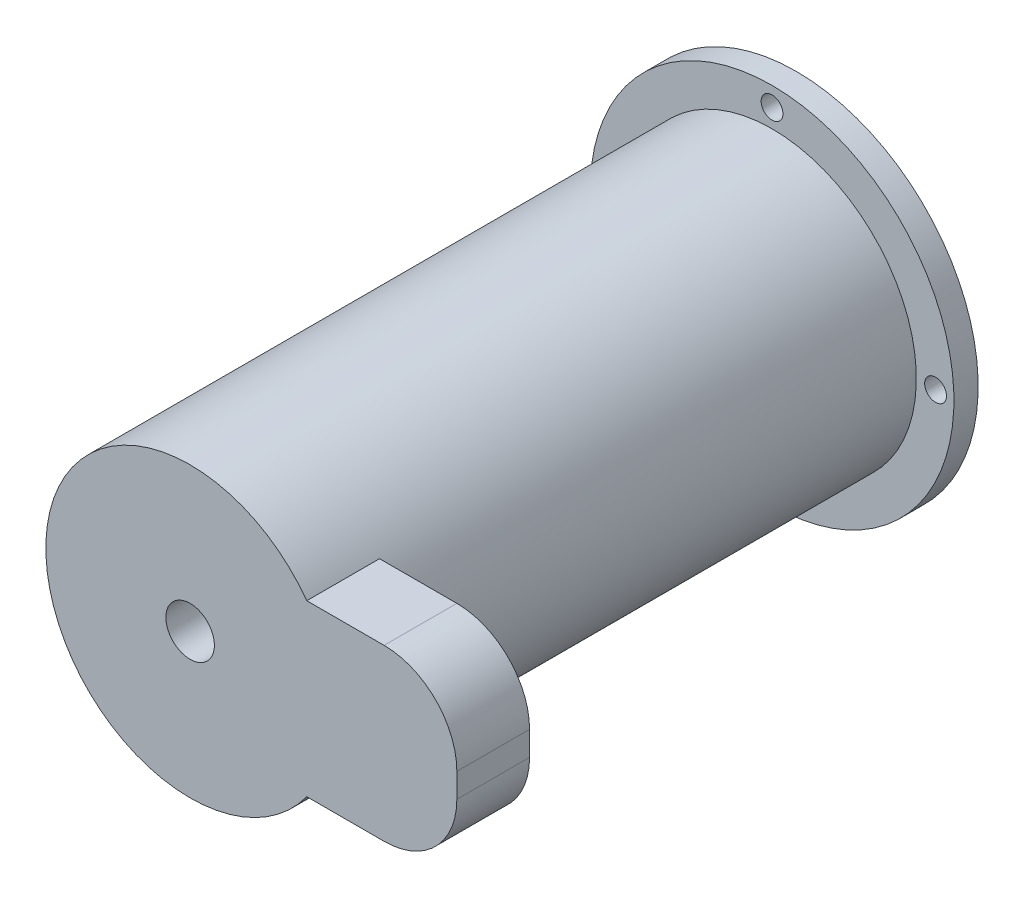
ISO-10303-21;
HEADER;
FILE_DESCRIPTION(('STEP AP214'),'2;1');
FILE_NAME('part.step','',(''),(''),'','','');
FILE_SCHEMA(('AUTOMOTIVE_DESIGN { 1 0 10303 214 1 1 1 1 }'));
ENDSEC;
DATA;
#1=APPLICATION_CONTEXT('core data for automotive mechanical design processes');
#2=APPLICATION_PROTOCOL_DEFINITION('international standard','automotive_design',2000,#1);
#3=PRODUCT_CONTEXT('',#1,'mechanical');
#4=PRODUCT('Part','Part','',(#3));
#5=PRODUCT_RELATED_PRODUCT_CATEGORY('part','',(#4));
#6=PRODUCT_DEFINITION_FORMATION('','',#4);
#7=PRODUCT_DEFINITION_CONTEXT('part definition',#1,'design');
#8=PRODUCT_DEFINITION('design','',#6,#7);
#9=PRODUCT_DEFINITION_SHAPE('','',#8);
#10=(LENGTH_UNIT() NAMED_UNIT(*) SI_UNIT(.MILLI.,.METRE.));
#11=(NAMED_UNIT(*) PLANE_ANGLE_UNIT() SI_UNIT($,.RADIAN.));
#12=(NAMED_UNIT(*) SI_UNIT($,.STERADIAN.) SOLID_ANGLE_UNIT());
#13=UNCERTAINTY_MEASURE_WITH_UNIT(LENGTH_MEASURE(1.E-05),#10,'distance_accuracy_value','');
#14=(GEOMETRIC_REPRESENTATION_CONTEXT(3) GLOBAL_UNCERTAINTY_ASSIGNED_CONTEXT((#13)) GLOBAL_UNIT_ASSIGNED_CONTEXT((#10,
#11,#12)) REPRESENTATION_CONTEXT('',''));
#15=CARTESIAN_POINT('',(0.,0.,0.));
#16=DIRECTION('',(0.,0.,1.));
#17=DIRECTION('',(1.,0.,0.));
#18=AXIS2_PLACEMENT_3D('',#15,#16,#17);
#19=CARTESIAN_POINT('',(0.,0.,10.));
#20=DIRECTION('',(0.,0.,1.));
#21=DIRECTION('',(0.,-1.,0.));
#22=AXIS2_PLACEMENT_3D('',#19,#20,#21);
#23=PLANE('',#22);
#24=CARTESIAN_POINT('',(0.,0.,10.));
#25=DIRECTION('',(0.,0.,1.));
#26=DIRECTION('',(0.,-1.,0.));
#27=AXIS2_PLACEMENT_3D('',#24,#25,#26);
#28=CIRCLE('',#27,75.);
#29=CARTESIAN_POINT('',(0.,-75.0000000000001,9.99999999999974));
#30=VERTEX_POINT('',#29);
#31=EDGE_CURVE('E41',#30,#30,#28,.T.);
#32=ORIENTED_EDGE('',*,*,#31,.T.);
#33=EDGE_LOOP('',(#32));
#34=FACE_BOUND('',#33,.T.);
#35=CARTESIAN_POINT('',(0.,0.,10.));
#36=DIRECTION('',(0.,0.,1.));
#37=DIRECTION('',(0.,-1.,0.));
#38=AXIS2_PLACEMENT_3D('',#35,#36,#37);
#39=CIRCLE('',#38,59.5);
#40=CARTESIAN_POINT('',(0.,-59.5,9.99999999999979));
#41=VERTEX_POINT('',#40);
#42=EDGE_CURVE('E11',#41,#41,#39,.T.);
#43=ORIENTED_EDGE('',*,*,#42,.F.);
#44=EDGE_LOOP('',(#43));
#45=FACE_BOUND('',#44,.T.);
#46=CARTESIAN_POINT('',(0.,67.096454414128,10.0000000000002));
#47=DIRECTION('',(0.,0.,1.));
#48=DIRECTION('',(0.,-1.,0.));
#49=AXIS2_PLACEMENT_3D('',#46,#47,#48);
#50=CIRCLE('',#49,4.5);
#51=CARTESIAN_POINT('',(0.,62.596454414128,10.0000000000002));
#52=VERTEX_POINT('',#51);
#53=EDGE_CURVE('E175',#52,#52,#50,.T.);
#54=ORIENTED_EDGE('',*,*,#53,.F.);
#55=EDGE_LOOP('',(#54));
#56=FACE_BOUND('',#55,.T.);
#57=CARTESIAN_POINT('',(-67.4401460234851,0.,10.));
#58=DIRECTION('',(0.,0.,1.));
#59=DIRECTION('',(0.,-1.,0.));
#60=AXIS2_PLACEMENT_3D('',#57,#58,#59);
#61=CIRCLE('',#60,4.49999999999999);
#62=CARTESIAN_POINT('',(-67.4401460234851,-4.50000000000003,9.99999999999998));
#63=VERTEX_POINT('',#62);
#64=EDGE_CURVE('E171',#63,#63,#61,.T.);
#65=ORIENTED_EDGE('',*,*,#64,.F.);
#66=EDGE_LOOP('',(#65));
#67=FACE_BOUND('',#66,.T.);
#68=CARTESIAN_POINT('',(0.,-67.0964544141281,9.99999999999977));
#69=DIRECTION('',(0.,0.,-1.));
#70=DIRECTION('',(0.,1.,0.));
#71=AXIS2_PLACEMENT_3D('',#68,#69,#70);
#72=CIRCLE('',#71,4.5);
#73=CARTESIAN_POINT('',(0.,-62.5964544141281,9.99999999999978));
#74=VERTEX_POINT('',#73);
#75=EDGE_CURVE('E159',#74,#74,#72,.T.);
#76=ORIENTED_EDGE('',*,*,#75,.T.);
#77=EDGE_LOOP('',(#76));
#78=FACE_BOUND('',#77,.T.);
#79=CARTESIAN_POINT('',(67.4401460234851,0.,10.));
#80=DIRECTION('',(0.,0.,-1.));
#81=DIRECTION('',(0.,-1.,0.));
#82=AXIS2_PLACEMENT_3D('',#79,#80,#81);
#83=CIRCLE('',#82,4.49999999999999);
#84=CARTESIAN_POINT('',(67.4401460234851,-4.50000000000003,9.99999999999998));
#85=VERTEX_POINT('',#84);
#86=EDGE_CURVE('E160',#85,#85,#83,.T.);
#87=ORIENTED_EDGE('',*,*,#86,.T.);
#88=EDGE_LOOP('',(#87));
#89=FACE_BOUND('',#88,.T.);
#90=ADVANCED_FACE('F32',(#34,#45,#56,#67,#78,#89),#23,.T.);
#91=CARTESIAN_POINT('',(0.,0.,0.));
#92=DIRECTION('',(0.,0.,1.));
#93=DIRECTION('',(0.,-1.,0.));
#94=AXIS2_PLACEMENT_3D('',#91,#92,#93);
#95=PLANE('',#94);
#96=CARTESIAN_POINT('',(0.,-67.0964544141281,-2.34266018489467E-13));
#97=DIRECTION('',(0.,0.,1.));
#98=DIRECTION('',(0.,-1.,0.));
#99=AXIS2_PLACEMENT_3D('',#96,#97,#98);
#100=CIRCLE('',#99,4.5);
#101=CARTESIAN_POINT('',(0.,-71.5964544141281,-2.49977684514261E-13));
#102=VERTEX_POINT('',#101);
#103=EDGE_CURVE('E163',#102,#102,#100,.T.);
#104=ORIENTED_EDGE('',*,*,#103,.T.);
#105=EDGE_LOOP('',(#104));
#106=FACE_BOUND('',#105,.T.);
#107=CARTESIAN_POINT('',(-67.4401460234851,0.,0.));
#108=DIRECTION('',(0.,0.,1.));
#109=DIRECTION('',(0.,-1.,0.));
#110=AXIS2_PLACEMENT_3D('',#107,#108,#109);
#111=CIRCLE('',#110,4.49999999999999);
#112=CARTESIAN_POINT('',(-67.4401460234851,-4.49999999999999,0.));
#113=VERTEX_POINT('',#112);
#114=EDGE_CURVE('E174',#113,#113,#111,.F.);
#115=ORIENTED_EDGE('',*,*,#114,.F.);
#116=EDGE_LOOP('',(#115));
#117=FACE_BOUND('',#116,.T.);
#118=CARTESIAN_POINT('',(0.,67.0964544141281,2.34266018489467E-13));
#119=DIRECTION('',(0.,0.,1.));
#120=DIRECTION('',(0.,-1.,0.));
#121=AXIS2_PLACEMENT_3D('',#118,#119,#120);
#122=CIRCLE('',#121,4.5);
#123=CARTESIAN_POINT('',(0.,62.5964544141281,2.18554352464673E-13));
#124=VERTEX_POINT('',#123);
#125=EDGE_CURVE('E170',#124,#124,#122,.F.);
#126=ORIENTED_EDGE('',*,*,#125,.F.);
#127=EDGE_LOOP('',(#126));
#128=FACE_BOUND('',#127,.T.);
#129=CARTESIAN_POINT('',(0.,0.,0.));
#130=DIRECTION('',(0.,0.,1.));
#131=DIRECTION('',(0.,-1.,0.));
#132=AXIS2_PLACEMENT_3D('',#129,#130,#131);
#133=CIRCLE('',#132,75.);
#134=CARTESIAN_POINT('',(0.,-75.,-2.61861100413235E-13));
#135=VERTEX_POINT('',#134);
#136=EDGE_CURVE('E36',#135,#135,#133,.T.);
#137=ORIENTED_EDGE('',*,*,#136,.F.);
#138=EDGE_LOOP('',(#137));
#139=FACE_BOUND('',#138,.T.);
#140=CARTESIAN_POINT('',(67.4401460234851,0.,0.));
#141=DIRECTION('',(0.,0.,1.));
#142=DIRECTION('',(0.,-1.,0.));
#143=AXIS2_PLACEMENT_3D('',#140,#141,#142);
#144=CIRCLE('',#143,4.49999999999999);
#145=CARTESIAN_POINT('',(67.4401460234851,-4.49999999999999,0.));
#146=VERTEX_POINT('',#145);
#147=EDGE_CURVE('E157',#146,#146,#144,.T.);
#148=ORIENTED_EDGE('',*,*,#147,.T.);
#149=EDGE_LOOP('',(#148));
#150=FACE_BOUND('',#149,.T.);
#151=ADVANCED_FACE('F151',(#106,#117,#128,#139,#150),#95,.F.);
#152=CARTESIAN_POINT('',(0.,0.,10.));
#153=DIRECTION('',(0.,0.,-1.));
#154=DIRECTION('',(0.,1.,0.));
#155=AXIS2_PLACEMENT_3D('',#152,#153,#154);
#156=CYLINDRICAL_SURFACE('',#155,75.);
#157=ORIENTED_EDGE('',*,*,#31,.F.);
#158=EDGE_LOOP('',(#157));
#159=FACE_BOUND('',#158,.T.);
#160=ORIENTED_EDGE('',*,*,#136,.T.);
#161=EDGE_LOOP('',(#160));
#162=FACE_BOUND('',#161,.T.);
#163=ADVANCED_FACE('F34',(#159,#162),#156,.T.);
#164=CARTESIAN_POINT('',(0.,-8.72870334710783E-13,250.));
#165=DIRECTION('',(0.,0.,-1.));
#166=DIRECTION('',(0.,1.,0.));
#167=AXIS2_PLACEMENT_3D('',#164,#165,#166);
#168=CYLINDRICAL_SURFACE('',#167,59.5);
#169=CARTESIAN_POINT('',(0.,-7.68125894545489E-13,220.));
#170=DIRECTION('',(0.,0.,-1.));
#171=DIRECTION('',(0.,1.,0.));
#172=AXIS2_PLACEMENT_3D('',#169,#170,#171);
#173=CIRCLE('',#172,59.5);
#174=CARTESIAN_POINT('',(48.1170447970363,34.9999999999992,220.));
#175=VERTEX_POINT('',#174);
#176=CARTESIAN_POINT('',(48.1170447970363,-35.0000000000008,220.));
#177=VERTEX_POINT('',#176);
#178=EDGE_CURVE('E119',#175,#177,#173,.T.);
#179=ORIENTED_EDGE('',*,*,#178,.T.);
#180=DIRECTION('',(0.,0.,1.));
#181=VECTOR('',#180,1.);
#182=CARTESIAN_POINT('',(48.1170447970363,-35.0000000000008,220.));
#183=LINE('',#182,#181);
#184=CARTESIAN_POINT('',(48.1170447970363,-35.0000000000009,250.));
#185=VERTEX_POINT('',#184);
#186=EDGE_CURVE('E108',#177,#185,#183,.T.);
#187=ORIENTED_EDGE('',*,*,#186,.T.);
#188=CARTESIAN_POINT('',(0.,-8.72870334710783E-13,250.));
#189=DIRECTION('',(0.,0.,1.));
#190=DIRECTION('',(0.,-1.,0.));
#191=AXIS2_PLACEMENT_3D('',#188,#189,#190);
#192=CIRCLE('',#191,59.5);
#193=CARTESIAN_POINT('',(48.1170447970363,34.9999999999991,250.));
#194=VERTEX_POINT('',#193);
#195=EDGE_CURVE('E138',#194,#185,#192,.T.);
#196=ORIENTED_EDGE('',*,*,#195,.F.);
#197=DIRECTION('',(0.,0.,1.));
#198=VECTOR('',#197,1.);
#199=CARTESIAN_POINT('',(48.1170447970363,34.9999999999992,220.));
#200=LINE('',#199,#198);
#201=EDGE_CURVE('E141',#175,#194,#200,.T.);
#202=ORIENTED_EDGE('',*,*,#201,.F.);
#203=EDGE_LOOP('',(#179,#187,#196,#202));
#204=FACE_BOUND('',#203,.T.);
#205=ORIENTED_EDGE('',*,*,#42,.T.);
#206=EDGE_LOOP('',(#205));
#207=FACE_BOUND('',#206,.T.);
#208=ADVANCED_FACE('F191',(#204,#207),#168,.T.);
#209=CARTESIAN_POINT('',(0.,-8.72870334710783E-13,250.));
#210=DIRECTION('',(0.,0.,1.));
#211=DIRECTION('',(0.,-1.,0.));
#212=AXIS2_PLACEMENT_3D('',#209,#210,#211);
#213=PLANE('',#212);
#214=CARTESIAN_POINT('',(0.,-8.72870334710783E-13,250.));
#215=DIRECTION('',(0.,0.,1.));
#216=DIRECTION('',(0.,-1.,0.));
#217=AXIS2_PLACEMENT_3D('',#214,#215,#216);
#218=CIRCLE('',#217,10.);
#219=CARTESIAN_POINT('',(0.,-10.0000000000009,250.));
#220=VERTEX_POINT('',#219);
#221=EDGE_CURVE('E178',#220,#220,#218,.T.);
#222=ORIENTED_EDGE('',*,*,#221,.F.);
#223=EDGE_LOOP('',(#222));
#224=FACE_BOUND('',#223,.T.);
#225=ORIENTED_EDGE('',*,*,#195,.T.);
#226=DIRECTION('',(1.,0.,0.));
#227=VECTOR('',#226,1.);
#228=CARTESIAN_POINT('',(79.9999999999998,-35.0000000000009,250.));
#229=LINE('',#228,#227);
#230=CARTESIAN_POINT('',(79.9999999999998,-35.0000000000009,250.));
#231=VERTEX_POINT('',#230);
#232=EDGE_CURVE('E130',#185,#231,#229,.T.);
#233=ORIENTED_EDGE('',*,*,#232,.T.);
#234=CARTESIAN_POINT('',(80.,-5.00000000000087,250.));
#235=DIRECTION('',(0.,0.,1.));
#236=DIRECTION('',(0.,1.,0.));
#237=AXIS2_PLACEMENT_3D('',#234,#235,#236);
#238=CIRCLE('',#237,30.);
#239=CARTESIAN_POINT('',(110.,-5.00000000000065,250.));
#240=VERTEX_POINT('',#239);
#241=EDGE_CURVE('E103',#231,#240,#238,.T.);
#242=ORIENTED_EDGE('',*,*,#241,.T.);
#243=DIRECTION('',(0.,1.,0.));
#244=VECTOR('',#243,1.);
#245=CARTESIAN_POINT('',(110.,4.99999999999892,250.));
#246=LINE('',#245,#244);
#247=CARTESIAN_POINT('',(110.,4.99999999999892,250.));
#248=VERTEX_POINT('',#247);
#249=EDGE_CURVE('E133',#240,#248,#246,.T.);
#250=ORIENTED_EDGE('',*,*,#249,.T.);
#251=CARTESIAN_POINT('',(80.,4.99999999999913,250.));
#252=DIRECTION('',(0.,0.,1.));
#253=DIRECTION('',(0.,-1.,0.));
#254=AXIS2_PLACEMENT_3D('',#251,#252,#253);
#255=CIRCLE('',#254,30.);
#256=CARTESIAN_POINT('',(79.9999999999998,34.9999999999991,250.));
#257=VERTEX_POINT('',#256);
#258=EDGE_CURVE('E126',#248,#257,#255,.T.);
#259=ORIENTED_EDGE('',*,*,#258,.T.);
#260=DIRECTION('',(-1.,0.,0.));
#261=VECTOR('',#260,1.);
#262=CARTESIAN_POINT('',(48.1170447970363,34.9999999999991,250.));
#263=LINE('',#262,#261);
#264=EDGE_CURVE('E49',#257,#194,#263,.T.);
#265=ORIENTED_EDGE('',*,*,#264,.T.);
#266=EDGE_LOOP('',(#225,#233,#242,#250,#259,#265));
#267=FACE_BOUND('',#266,.T.);
#268=ADVANCED_FACE('F193',(#224,#267),#213,.T.);
#269=CARTESIAN_POINT('',(80.,4.99999999999924,220.));
#270=DIRECTION('',(0.,0.,1.));
#271=DIRECTION('',(0.,-1.,0.));
#272=AXIS2_PLACEMENT_3D('',#269,#270,#271);
#273=CYLINDRICAL_SURFACE('',#272,30.);
#274=ORIENTED_EDGE('',*,*,#258,.F.);
#275=DIRECTION('',(0.,0.,1.));
#276=VECTOR('',#275,1.);
#277=CARTESIAN_POINT('',(110.,4.99999999999902,220.));
#278=LINE('',#277,#276);
#279=CARTESIAN_POINT('',(110.,4.99999999999902,220.));
#280=VERTEX_POINT('',#279);
#281=EDGE_CURVE('E58',#280,#248,#278,.T.);
#282=ORIENTED_EDGE('',*,*,#281,.F.);
#283=CARTESIAN_POINT('',(80.,4.99999999999924,220.));
#284=DIRECTION('',(0.,0.,1.));
#285=DIRECTION('',(0.,-1.,0.));
#286=AXIS2_PLACEMENT_3D('',#283,#284,#285);
#287=CIRCLE('',#286,30.);
#288=CARTESIAN_POINT('',(79.9999999999998,34.9999999999992,220.));
#289=VERTEX_POINT('',#288);
#290=EDGE_CURVE('E136',#280,#289,#287,.T.);
#291=ORIENTED_EDGE('',*,*,#290,.T.);
#292=DIRECTION('',(0.,0.,1.));
#293=VECTOR('',#292,1.);
#294=CARTESIAN_POINT('',(79.9999999999998,34.9999999999992,220.));
#295=LINE('',#294,#293);
#296=EDGE_CURVE('E86',#289,#257,#295,.T.);
#297=ORIENTED_EDGE('',*,*,#296,.T.);
#298=EDGE_LOOP('',(#274,#282,#291,#297));
#299=FACE_BOUND('',#298,.T.);
#300=ADVANCED_FACE('F196',(#299),#273,.T.);
#301=CARTESIAN_POINT('',(110.,4.99999999999902,220.));
#302=DIRECTION('',(1.,0.,0.));
#303=DIRECTION('',(0.,1.,0.));
#304=AXIS2_PLACEMENT_3D('',#301,#302,#303);
#305=PLANE('',#304);
#306=ORIENTED_EDGE('',*,*,#249,.F.);
#307=DIRECTION('',(0.,0.,1.));
#308=VECTOR('',#307,1.);
#309=CARTESIAN_POINT('',(110.,-5.00000000000055,220.));
#310=LINE('',#309,#308);
#311=CARTESIAN_POINT('',(110.,-5.00000000000055,220.));
#312=VERTEX_POINT('',#311);
#313=EDGE_CURVE('E107',#312,#240,#310,.T.);
#314=ORIENTED_EDGE('',*,*,#313,.F.);
#315=DIRECTION('',(0.,1.,0.));
#316=VECTOR('',#315,1.);
#317=CARTESIAN_POINT('',(110.,4.99999999999902,220.));
#318=LINE('',#317,#316);
#319=EDGE_CURVE('E115',#312,#280,#318,.T.);
#320=ORIENTED_EDGE('',*,*,#319,.T.);
#321=ORIENTED_EDGE('',*,*,#281,.T.);
#322=EDGE_LOOP('',(#306,#314,#320,#321));
#323=FACE_BOUND('',#322,.T.);
#324=ADVANCED_FACE('F194',(#323),#305,.T.);
#325=CARTESIAN_POINT('',(80.,-5.00000000000076,220.));
#326=DIRECTION('',(0.,0.,1.));
#327=DIRECTION('',(0.,-1.,0.));
#328=AXIS2_PLACEMENT_3D('',#325,#326,#327);
#329=CYLINDRICAL_SURFACE('',#328,30.);
#330=ORIENTED_EDGE('',*,*,#241,.F.);
#331=DIRECTION('',(0.,0.,1.));
#332=VECTOR('',#331,1.);
#333=CARTESIAN_POINT('',(79.9999999999998,-35.0000000000008,220.));
#334=LINE('',#333,#332);
#335=CARTESIAN_POINT('',(79.9999999999998,-35.0000000000008,220.));
#336=VERTEX_POINT('',#335);
#337=EDGE_CURVE('E97',#336,#231,#334,.T.);
#338=ORIENTED_EDGE('',*,*,#337,.F.);
#339=CARTESIAN_POINT('',(80.,-5.00000000000076,220.));
#340=DIRECTION('',(0.,0.,1.));
#341=DIRECTION('',(0.,1.,0.));
#342=AXIS2_PLACEMENT_3D('',#339,#340,#341);
#343=CIRCLE('',#342,30.);
#344=EDGE_CURVE('E100',#336,#312,#343,.T.);
#345=ORIENTED_EDGE('',*,*,#344,.T.);
#346=ORIENTED_EDGE('',*,*,#313,.T.);
#347=EDGE_LOOP('',(#330,#338,#345,#346));
#348=FACE_BOUND('',#347,.T.);
#349=ADVANCED_FACE('F99',(#348),#329,.T.);
#350=CARTESIAN_POINT('',(79.9999999999998,-35.0000000000008,220.));
#351=DIRECTION('',(0.,-1.,0.));
#352=DIRECTION('',(1.,0.,0.));
#353=AXIS2_PLACEMENT_3D('',#350,#351,#352);
#354=PLANE('',#353);
#355=ORIENTED_EDGE('',*,*,#232,.F.);
#356=ORIENTED_EDGE('',*,*,#186,.F.);
#357=DIRECTION('',(1.,0.,0.));
#358=VECTOR('',#357,1.);
#359=CARTESIAN_POINT('',(79.9999999999998,-35.0000000000008,220.));
#360=LINE('',#359,#358);
#361=EDGE_CURVE('E113',#177,#336,#360,.T.);
#362=ORIENTED_EDGE('',*,*,#361,.T.);
#363=ORIENTED_EDGE('',*,*,#337,.T.);
#364=EDGE_LOOP('',(#355,#356,#362,#363));
#365=FACE_BOUND('',#364,.T.);
#366=ADVANCED_FACE('F117',(#365),#354,.T.);
#367=CARTESIAN_POINT('',(48.1170447970363,34.9999999999992,220.));
#368=DIRECTION('',(0.,1.,0.));
#369=DIRECTION('',(-1.,0.,0.));
#370=AXIS2_PLACEMENT_3D('',#367,#368,#369);
#371=PLANE('',#370);
#372=ORIENTED_EDGE('',*,*,#264,.F.);
#373=ORIENTED_EDGE('',*,*,#296,.F.);
#374=DIRECTION('',(-1.,0.,0.));
#375=VECTOR('',#374,1.);
#376=CARTESIAN_POINT('',(48.1170447970363,34.9999999999992,220.));
#377=LINE('',#376,#375);
#378=EDGE_CURVE('E121',#289,#175,#377,.T.);
#379=ORIENTED_EDGE('',*,*,#378,.T.);
#380=ORIENTED_EDGE('',*,*,#201,.T.);
#381=EDGE_LOOP('',(#372,#373,#379,#380));
#382=FACE_BOUND('',#381,.T.);
#383=ADVANCED_FACE('F188',(#382),#371,.T.);
#384=CARTESIAN_POINT('',(80.,4.99999999999924,220.));
#385=DIRECTION('',(0.,0.,1.));
#386=DIRECTION('',(0.,-1.,0.));
#387=AXIS2_PLACEMENT_3D('',#384,#385,#386);
#388=PLANE('',#387);
#389=ORIENTED_EDGE('',*,*,#290,.F.);
#390=ORIENTED_EDGE('',*,*,#319,.F.);
#391=ORIENTED_EDGE('',*,*,#344,.F.);
#392=ORIENTED_EDGE('',*,*,#361,.F.);
#393=ORIENTED_EDGE('',*,*,#178,.F.);
#394=ORIENTED_EDGE('',*,*,#378,.F.);
#395=EDGE_LOOP('',(#389,#390,#391,#392,#393,#394));
#396=FACE_BOUND('',#395,.T.);
#397=ADVANCED_FACE('F112',(#396),#388,.F.);
#398=CARTESIAN_POINT('',(0.,-7.68125894545489E-13,220.));
#399=DIRECTION('',(0.,0.,1.));
#400=DIRECTION('',(0.,-1.,0.));
#401=AXIS2_PLACEMENT_3D('',#398,#399,#400);
#402=CYLINDRICAL_SURFACE('',#401,10.);
#403=CARTESIAN_POINT('',(0.,-7.68125894545489E-13,220.));
#404=DIRECTION('',(0.,0.,1.));
#405=DIRECTION('',(0.,-1.,0.));
#406=AXIS2_PLACEMENT_3D('',#403,#404,#405);
#407=CIRCLE('',#406,10.);
#408=CARTESIAN_POINT('',(0.,-10.0000000000008,220.));
#409=VERTEX_POINT('',#408);
#410=EDGE_CURVE('E128',#409,#409,#407,.T.);
#411=ORIENTED_EDGE('',*,*,#410,.F.);
#412=EDGE_LOOP('',(#411));
#413=FACE_BOUND('',#412,.T.);
#414=ORIENTED_EDGE('',*,*,#221,.T.);
#415=EDGE_LOOP('',(#414));
#416=FACE_BOUND('',#415,.T.);
#417=ADVANCED_FACE('F233',(#413,#416),#402,.F.);
#418=CARTESIAN_POINT('',(0.,-7.68125894545489E-13,220.));
#419=DIRECTION('',(0.,0.,1.));
#420=DIRECTION('',(0.,-1.,0.));
#421=AXIS2_PLACEMENT_3D('',#418,#419,#420);
#422=PLANE('',#421);
#423=ORIENTED_EDGE('',*,*,#410,.T.);
#424=EDGE_LOOP('',(#423));
#425=FACE_BOUND('',#424,.T.);
#426=ADVANCED_FACE('F239',(#425),#422,.T.);
#427=CARTESIAN_POINT('',(0.,67.0964544141281,-12.7279220613576));
#428=DIRECTION('',(0.,0.,1.));
#429=DIRECTION('',(0.,-1.,0.));
#430=AXIS2_PLACEMENT_3D('',#427,#428,#429);
#431=CYLINDRICAL_SURFACE('',#430,4.5);
#432=ORIENTED_EDGE('',*,*,#125,.T.);
#433=EDGE_LOOP('',(#432));
#434=FACE_BOUND('',#433,.T.);
#435=ORIENTED_EDGE('',*,*,#53,.T.);
#436=EDGE_LOOP('',(#435));
#437=FACE_BOUND('',#436,.T.);
#438=ADVANCED_FACE('F247',(#434,#437),#431,.F.);
#439=CARTESIAN_POINT('',(-67.4401460234851,0.,-12.7279220613579));
#440=DIRECTION('',(0.,0.,1.));
#441=DIRECTION('',(0.,-1.,0.));
#442=AXIS2_PLACEMENT_3D('',#439,#440,#441);
#443=CYLINDRICAL_SURFACE('',#442,4.49999999999999);
#444=ORIENTED_EDGE('',*,*,#114,.T.);
#445=EDGE_LOOP('',(#444));
#446=FACE_BOUND('',#445,.T.);
#447=ORIENTED_EDGE('',*,*,#64,.T.);
#448=EDGE_LOOP('',(#447));
#449=FACE_BOUND('',#448,.T.);
#450=ADVANCED_FACE('F255',(#446,#449),#443,.F.);
#451=CARTESIAN_POINT('',(0.,-67.096454414128,-12.7279220613581));
#452=DIRECTION('',(0.,0.,1.));
#453=DIRECTION('',(0.,-1.,0.));
#454=AXIS2_PLACEMENT_3D('',#451,#452,#453);
#455=CYLINDRICAL_SURFACE('',#454,4.5);
#456=ORIENTED_EDGE('',*,*,#103,.F.);
#457=EDGE_LOOP('',(#456));
#458=FACE_BOUND('',#457,.T.);
#459=ORIENTED_EDGE('',*,*,#75,.F.);
#460=EDGE_LOOP('',(#459));
#461=FACE_BOUND('',#460,.T.);
#462=ADVANCED_FACE('F263',(#458,#461),#455,.F.);
#463=CARTESIAN_POINT('',(67.4401460234851,0.,-12.7279220613579));
#464=DIRECTION('',(0.,0.,1.));
#465=DIRECTION('',(0.,-1.,0.));
#466=AXIS2_PLACEMENT_3D('',#463,#464,#465);
#467=CYLINDRICAL_SURFACE('',#466,4.49999999999999);
#468=ORIENTED_EDGE('',*,*,#147,.F.);
#469=EDGE_LOOP('',(#468));
#470=FACE_BOUND('',#469,.T.);
#471=ORIENTED_EDGE('',*,*,#86,.F.);
#472=EDGE_LOOP('',(#471));
#473=FACE_BOUND('',#472,.T.);
#474=ADVANCED_FACE('F271',(#470,#473),#467,.F.);
#475=CLOSED_SHELL('',(#90,#151,#163,#208,#268,#300,#324,#349,#366,#383,#397,#417,#426,#438,#450,
#462,#474));
#476=MANIFOLD_SOLID_BREP('B2',#475);
#477=ADVANCED_BREP_SHAPE_REPRESENTATION('',(#18,#476),#14);
#478=SHAPE_DEFINITION_REPRESENTATION(#9,#477);
ENDSEC;
END-ISO-10303-21;
